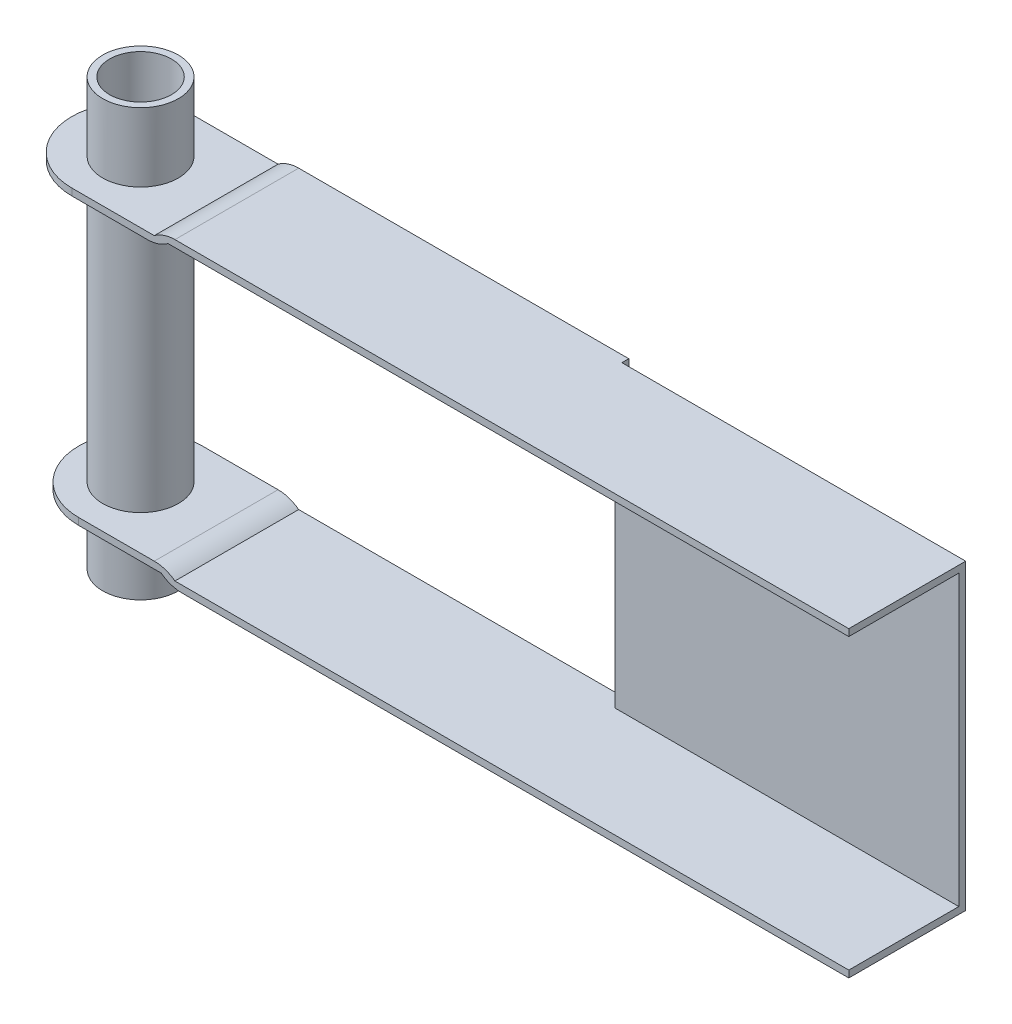
ISO-10303-21;
HEADER;
FILE_DESCRIPTION(('STEP AP214'),'2;1');
FILE_NAME('part.step','',(''),(''),'','','');
FILE_SCHEMA(('AUTOMOTIVE_DESIGN { 1 0 10303 214 1 1 1 1 }'));
ENDSEC;
DATA;
#1=APPLICATION_CONTEXT('core data for automotive mechanical design processes');
#2=APPLICATION_PROTOCOL_DEFINITION('international standard','automotive_design',2000,#1);
#3=PRODUCT_CONTEXT('',#1,'mechanical');
#4=PRODUCT('Part','Part','',(#3));
#5=PRODUCT_RELATED_PRODUCT_CATEGORY('part','',(#4));
#6=PRODUCT_DEFINITION_FORMATION('','',#4);
#7=PRODUCT_DEFINITION_CONTEXT('part definition',#1,'design');
#8=PRODUCT_DEFINITION('design','',#6,#7);
#9=PRODUCT_DEFINITION_SHAPE('','',#8);
#10=(LENGTH_UNIT() NAMED_UNIT(*) SI_UNIT(.MILLI.,.METRE.));
#11=(NAMED_UNIT(*) PLANE_ANGLE_UNIT() SI_UNIT($,.RADIAN.));
#12=(NAMED_UNIT(*) SI_UNIT($,.STERADIAN.) SOLID_ANGLE_UNIT());
#13=UNCERTAINTY_MEASURE_WITH_UNIT(LENGTH_MEASURE(1.E-05),#10,'distance_accuracy_value','');
#14=(GEOMETRIC_REPRESENTATION_CONTEXT(3) GLOBAL_UNCERTAINTY_ASSIGNED_CONTEXT((#13)) GLOBAL_UNIT_ASSIGNED_CONTEXT((#10,
#11,#12)) REPRESENTATION_CONTEXT('',''));
#15=CARTESIAN_POINT('',(0.,0.,0.));
#16=DIRECTION('',(0.,0.,1.));
#17=DIRECTION('',(1.,0.,0.));
#18=AXIS2_PLACEMENT_3D('',#15,#16,#17);
#19=CARTESIAN_POINT('',(-62.,11.,8.));
#20=DIRECTION('',(0.,-1.,0.));
#21=DIRECTION('',(0.,0.,-1.));
#22=AXIS2_PLACEMENT_3D('',#19,#20,#21);
#23=CYLINDRICAL_SURFACE('',#22,5.5);
#24=CARTESIAN_POINT('',(-62.,-1.,8.));
#25=DIRECTION('',(0.,-1.,0.));
#26=DIRECTION('',(0.,0.,-1.));
#27=AXIS2_PLACEMENT_3D('',#24,#25,#26);
#28=CIRCLE('',#27,5.5);
#29=CARTESIAN_POINT('',(-62.,-1.,2.50000000000001));
#30=VERTEX_POINT('',#29);
#31=EDGE_CURVE('E45',#30,#30,#28,.T.);
#32=ORIENTED_EDGE('',*,*,#31,.F.);
#33=EDGE_LOOP('',(#32));
#34=FACE_BOUND('',#33,.T.);
#35=CARTESIAN_POINT('',(-62.,9.00000000000002,8.));
#36=DIRECTION('',(0.,1.,0.));
#37=DIRECTION('',(0.,0.,1.));
#38=AXIS2_PLACEMENT_3D('',#35,#36,#37);
#39=CIRCLE('',#38,5.5);
#40=CARTESIAN_POINT('',(-62.,9.00000000000002,13.5));
#41=VERTEX_POINT('',#40);
#42=EDGE_CURVE('E568',#41,#41,#39,.T.);
#43=ORIENTED_EDGE('',*,*,#42,.F.);
#44=EDGE_LOOP('',(#43));
#45=FACE_BOUND('',#44,.T.);
#46=ADVANCED_FACE('F41',(#34,#45),#23,.T.);
#47=CARTESIAN_POINT('',(0.,-43.,17.));
#48=DIRECTION('',(0.,1.,0.));
#49=DIRECTION('',(0.,0.,1.));
#50=AXIS2_PLACEMENT_3D('',#47,#48,#49);
#51=PLANE('',#50);
#52=DIRECTION('',(1.,0.,0.));
#53=VECTOR('',#52,1.);
#54=CARTESIAN_POINT('',(-50.,-43.,-0.999999999999997));
#55=LINE('',#54,#53);
#56=CARTESIAN_POINT('',(-48.,-43.,-0.999999999999997));
#57=VERTEX_POINT('',#56);
#58=CARTESIAN_POINT('',(0.,-43.,-0.999999999999997));
#59=VERTEX_POINT('',#58);
#60=EDGE_CURVE('E218',#57,#59,#55,.T.);
#61=ORIENTED_EDGE('',*,*,#60,.F.);
#62=DIRECTION('',(0.,0.,-1.));
#63=VECTOR('',#62,1.);
#64=CARTESIAN_POINT('',(-48.,-43.,-0.999999999999997));
#65=LINE('',#64,#63);
#66=CARTESIAN_POINT('',(-48.,-43.,17.));
#67=VERTEX_POINT('',#66);
#68=EDGE_CURVE('E203',#67,#57,#65,.T.);
#69=ORIENTED_EDGE('',*,*,#68,.F.);
#70=DIRECTION('',(1.,0.,0.));
#71=VECTOR('',#70,1.);
#72=CARTESIAN_POINT('',(0.,-43.,17.));
#73=LINE('',#72,#71);
#74=CARTESIAN_POINT('',(50.,-43.,17.));
#75=VERTEX_POINT('',#74);
#76=EDGE_CURVE('E215',#67,#75,#73,.T.);
#77=ORIENTED_EDGE('',*,*,#76,.T.);
#78=DIRECTION('',(0.,0.,-1.));
#79=VECTOR('',#78,1.);
#80=CARTESIAN_POINT('',(50.,-43.,17.));
#81=LINE('',#80,#79);
#82=CARTESIAN_POINT('',(50.,-43.,1.));
#83=VERTEX_POINT('',#82);
#84=EDGE_CURVE('E236',#75,#83,#81,.T.);
#85=ORIENTED_EDGE('',*,*,#84,.T.);
#86=DIRECTION('',(1.,0.,0.));
#87=VECTOR('',#86,1.);
#88=CARTESIAN_POINT('',(0.,-43.,1.));
#89=LINE('',#88,#87);
#90=CARTESIAN_POINT('',(0.,-43.,1.));
#91=VERTEX_POINT('',#90);
#92=EDGE_CURVE('E228',#91,#83,#89,.T.);
#93=ORIENTED_EDGE('',*,*,#92,.F.);
#94=DIRECTION('',(0.,0.,-1.));
#95=VECTOR('',#94,1.);
#96=CARTESIAN_POINT('',(0.,-43.,0.));
#97=LINE('',#96,#95);
#98=CARTESIAN_POINT('',(0.,-43.,0.));
#99=VERTEX_POINT('',#98);
#100=EDGE_CURVE('E276',#91,#99,#97,.T.);
#101=ORIENTED_EDGE('',*,*,#100,.T.);
#102=EDGE_CURVE('E374',#99,#59,#97,.T.);
#103=ORIENTED_EDGE('',*,*,#102,.T.);
#104=EDGE_LOOP('',(#61,#69,#77,#85,#93,#101,#103));
#105=FACE_BOUND('',#104,.T.);
#106=ADVANCED_FACE('F213',(#105),#51,.T.);
#107=CARTESIAN_POINT('',(0.,0.,1.));
#108=DIRECTION('',(1.,0.,0.));
#109=DIRECTION('',(0.,0.,-1.));
#110=AXIS2_PLACEMENT_3D('',#107,#108,#109);
#111=PLANE('',#110);
#112=DIRECTION('',(0.,-1.,0.));
#113=VECTOR('',#112,1.);
#114=CARTESIAN_POINT('',(0.,0.,1.));
#115=LINE('',#114,#113);
#116=CARTESIAN_POINT('',(0.,-1.,1.));
#117=VERTEX_POINT('',#116);
#118=EDGE_CURVE('E255',#117,#91,#115,.T.);
#119=ORIENTED_EDGE('',*,*,#118,.F.);
#120=DIRECTION('',(0.,0.,-1.));
#121=VECTOR('',#120,1.);
#122=CARTESIAN_POINT('',(0.,-1.,0.));
#123=LINE('',#122,#121);
#124=CARTESIAN_POINT('',(0.,-1.,0.));
#125=VERTEX_POINT('',#124);
#126=EDGE_CURVE('E366',#117,#125,#123,.T.);
#127=ORIENTED_EDGE('',*,*,#126,.T.);
#128=DIRECTION('',(0.,-1.,0.));
#129=VECTOR('',#128,1.);
#130=CARTESIAN_POINT('',(0.,0.,0.));
#131=LINE('',#130,#129);
#132=EDGE_CURVE('E265',#125,#99,#131,.T.);
#133=ORIENTED_EDGE('',*,*,#132,.T.);
#134=ORIENTED_EDGE('',*,*,#100,.F.);
#135=EDGE_LOOP('',(#119,#127,#133,#134));
#136=FACE_BOUND('',#135,.T.);
#137=ADVANCED_FACE('F446',(#136),#111,.F.);
#138=CARTESIAN_POINT('',(0.,0.,1.));
#139=DIRECTION('',(0.,0.,1.));
#140=DIRECTION('',(1.,0.,0.));
#141=AXIS2_PLACEMENT_3D('',#138,#139,#140);
#142=PLANE('',#141);
#143=ORIENTED_EDGE('',*,*,#92,.T.);
#144=DIRECTION('',(0.,1.,0.));
#145=VECTOR('',#144,1.);
#146=CARTESIAN_POINT('',(50.,0.,1.));
#147=LINE('',#146,#145);
#148=CARTESIAN_POINT('',(50.,-1.,1.));
#149=VERTEX_POINT('',#148);
#150=EDGE_CURVE('E258',#83,#149,#147,.T.);
#151=ORIENTED_EDGE('',*,*,#150,.T.);
#152=DIRECTION('',(-1.,0.,0.));
#153=VECTOR('',#152,1.);
#154=CARTESIAN_POINT('',(0.,-1.,1.));
#155=LINE('',#154,#153);
#156=EDGE_CURVE('E239',#149,#117,#155,.T.);
#157=ORIENTED_EDGE('',*,*,#156,.T.);
#158=ORIENTED_EDGE('',*,*,#118,.T.);
#159=EDGE_LOOP('',(#143,#151,#157,#158));
#160=FACE_BOUND('',#159,.T.);
#161=ADVANCED_FACE('F448',(#160),#142,.T.);
#162=CARTESIAN_POINT('',(0.,-44.,1.));
#163=DIRECTION('',(0.,1.,0.));
#164=DIRECTION('',(0.,0.,1.));
#165=AXIS2_PLACEMENT_3D('',#162,#163,#164);
#166=PLANE('',#165);
#167=DIRECTION('',(1.,0.,0.));
#168=VECTOR('',#167,1.);
#169=CARTESIAN_POINT('',(0.,-44.,17.));
#170=LINE('',#169,#168);
#171=CARTESIAN_POINT('',(-47.,-44.,17.));
#172=VERTEX_POINT('',#171);
#173=CARTESIAN_POINT('',(50.,-44.,17.));
#174=VERTEX_POINT('',#173);
#175=EDGE_CURVE('E227',#172,#174,#170,.T.);
#176=ORIENTED_EDGE('',*,*,#175,.F.);
#177=DIRECTION('',(0.,0.,-1.));
#178=VECTOR('',#177,1.);
#179=CARTESIAN_POINT('',(-47.,-44.,1.));
#180=LINE('',#179,#178);
#181=CARTESIAN_POINT('',(-47.,-44.,-0.999999999999997));
#182=VERTEX_POINT('',#181);
#183=EDGE_CURVE('E320',#172,#182,#180,.T.);
#184=ORIENTED_EDGE('',*,*,#183,.T.);
#185=DIRECTION('',(1.,0.,0.));
#186=VECTOR('',#185,1.);
#187=CARTESIAN_POINT('',(-50.,-44.,-0.999999999999997));
#188=LINE('',#187,#186);
#189=CARTESIAN_POINT('',(0.,-44.,-0.999999999999997));
#190=VERTEX_POINT('',#189);
#191=EDGE_CURVE('E381',#182,#190,#188,.T.);
#192=ORIENTED_EDGE('',*,*,#191,.T.);
#193=DIRECTION('',(0.,0.,1.));
#194=VECTOR('',#193,1.);
#195=CARTESIAN_POINT('',(0.,-44.,0.));
#196=LINE('',#195,#194);
#197=CARTESIAN_POINT('',(0.,-44.,0.));
#198=VERTEX_POINT('',#197);
#199=EDGE_CURVE('E379',#190,#198,#196,.T.);
#200=ORIENTED_EDGE('',*,*,#199,.T.);
#201=DIRECTION('',(1.,0.,0.));
#202=VECTOR('',#201,1.);
#203=CARTESIAN_POINT('',(0.,-44.,0.));
#204=LINE('',#203,#202);
#205=CARTESIAN_POINT('',(50.,-44.,0.));
#206=VERTEX_POINT('',#205);
#207=EDGE_CURVE('E264',#198,#206,#204,.T.);
#208=ORIENTED_EDGE('',*,*,#207,.T.);
#209=DIRECTION('',(0.,0.,-1.));
#210=VECTOR('',#209,1.);
#211=CARTESIAN_POINT('',(50.,-44.,1.));
#212=LINE('',#211,#210);
#213=EDGE_CURVE('E273',#174,#206,#212,.T.);
#214=ORIENTED_EDGE('',*,*,#213,.F.);
#215=EDGE_LOOP('',(#176,#184,#192,#200,#208,#214));
#216=FACE_BOUND('',#215,.T.);
#217=ADVANCED_FACE('F397',(#216),#166,.F.);
#218=CARTESIAN_POINT('',(50.,0.,1.));
#219=DIRECTION('',(-1.,0.,0.));
#220=DIRECTION('',(0.,-1.,0.));
#221=AXIS2_PLACEMENT_3D('',#218,#219,#220);
#222=PLANE('',#221);
#223=DIRECTION('',(0.,1.,0.));
#224=VECTOR('',#223,1.);
#225=CARTESIAN_POINT('',(50.,0.,0.));
#226=LINE('',#225,#224);
#227=CARTESIAN_POINT('',(50.,0.,0.));
#228=VERTEX_POINT('',#227);
#229=EDGE_CURVE('E267',#206,#228,#226,.T.);
#230=ORIENTED_EDGE('',*,*,#229,.T.);
#231=DIRECTION('',(0.,0.,-1.));
#232=VECTOR('',#231,1.);
#233=CARTESIAN_POINT('',(50.,0.,1.));
#234=LINE('',#233,#232);
#235=CARTESIAN_POINT('',(50.,0.,17.));
#236=VERTEX_POINT('',#235);
#237=EDGE_CURVE('E261',#236,#228,#234,.T.);
#238=ORIENTED_EDGE('',*,*,#237,.F.);
#239=DIRECTION('',(0.,1.,0.));
#240=VECTOR('',#239,1.);
#241=CARTESIAN_POINT('',(50.,0.,17.));
#242=LINE('',#241,#240);
#243=CARTESIAN_POINT('',(50.,-1.,17.));
#244=VERTEX_POINT('',#243);
#245=EDGE_CURVE('E243',#244,#236,#242,.T.);
#246=ORIENTED_EDGE('',*,*,#245,.F.);
#247=DIRECTION('',(0.,0.,-1.));
#248=VECTOR('',#247,1.);
#249=CARTESIAN_POINT('',(50.,-1.,17.));
#250=LINE('',#249,#248);
#251=EDGE_CURVE('E249',#244,#149,#250,.T.);
#252=ORIENTED_EDGE('',*,*,#251,.T.);
#253=ORIENTED_EDGE('',*,*,#150,.F.);
#254=ORIENTED_EDGE('',*,*,#84,.F.);
#255=DIRECTION('',(0.,1.,0.));
#256=VECTOR('',#255,1.);
#257=CARTESIAN_POINT('',(50.,0.,17.));
#258=LINE('',#257,#256);
#259=EDGE_CURVE('E225',#174,#75,#258,.T.);
#260=ORIENTED_EDGE('',*,*,#259,.F.);
#261=ORIENTED_EDGE('',*,*,#213,.T.);
#262=EDGE_LOOP('',(#230,#238,#246,#252,#253,#254,#260,#261));
#263=FACE_BOUND('',#262,.T.);
#264=ADVANCED_FACE('F402',(#263),#222,.F.);
#265=CARTESIAN_POINT('',(0.,0.,1.));
#266=DIRECTION('',(0.,-1.,0.));
#267=DIRECTION('',(0.,0.,-1.));
#268=AXIS2_PLACEMENT_3D('',#265,#266,#267);
#269=PLANE('',#268);
#270=DIRECTION('',(1.,0.,0.));
#271=VECTOR('',#270,1.);
#272=CARTESIAN_POINT('',(-50.,0.,-0.999999999999997));
#273=LINE('',#272,#271);
#274=CARTESIAN_POINT('',(-48.,0.,-0.999999999999997));
#275=VERTEX_POINT('',#274);
#276=CARTESIAN_POINT('',(0.,0.,-0.999999999999997));
#277=VERTEX_POINT('',#276);
#278=EDGE_CURVE('E370',#275,#277,#273,.T.);
#279=ORIENTED_EDGE('',*,*,#278,.F.);
#280=DIRECTION('',(0.,0.,-1.));
#281=VECTOR('',#280,1.);
#282=CARTESIAN_POINT('',(-48.,0.,1.));
#283=LINE('',#282,#281);
#284=CARTESIAN_POINT('',(-48.,0.,17.));
#285=VERTEX_POINT('',#284);
#286=EDGE_CURVE('E324',#275,#285,#283,.F.);
#287=ORIENTED_EDGE('',*,*,#286,.T.);
#288=DIRECTION('',(-1.,0.,0.));
#289=VECTOR('',#288,1.);
#290=CARTESIAN_POINT('',(0.,0.,17.));
#291=LINE('',#290,#289);
#292=EDGE_CURVE('E246',#236,#285,#291,.T.);
#293=ORIENTED_EDGE('',*,*,#292,.F.);
#294=ORIENTED_EDGE('',*,*,#237,.T.);
#295=DIRECTION('',(-1.,0.,0.));
#296=VECTOR('',#295,1.);
#297=CARTESIAN_POINT('',(0.,0.,0.));
#298=LINE('',#297,#296);
#299=CARTESIAN_POINT('',(0.,0.,0.));
#300=VERTEX_POINT('',#299);
#301=EDGE_CURVE('E259',#228,#300,#298,.T.);
#302=ORIENTED_EDGE('',*,*,#301,.T.);
#303=DIRECTION('',(0.,0.,-1.));
#304=VECTOR('',#303,1.);
#305=CARTESIAN_POINT('',(0.,0.,0.));
#306=LINE('',#305,#304);
#307=EDGE_CURVE('E367',#300,#277,#306,.T.);
#308=ORIENTED_EDGE('',*,*,#307,.T.);
#309=EDGE_LOOP('',(#279,#287,#293,#294,#302,#308));
#310=FACE_BOUND('',#309,.T.);
#311=ADVANCED_FACE('F408',(#310),#269,.F.);
#312=CARTESIAN_POINT('',(0.,0.,0.));
#313=DIRECTION('',(0.,0.,1.));
#314=DIRECTION('',(1.,0.,0.));
#315=AXIS2_PLACEMENT_3D('',#312,#313,#314);
#316=PLANE('',#315);
#317=EDGE_CURVE('E262',#300,#125,#131,.T.);
#318=ORIENTED_EDGE('',*,*,#317,.F.);
#319=ORIENTED_EDGE('',*,*,#301,.F.);
#320=ORIENTED_EDGE('',*,*,#229,.F.);
#321=ORIENTED_EDGE('',*,*,#207,.F.);
#322=EDGE_CURVE('E254',#99,#198,#131,.T.);
#323=ORIENTED_EDGE('',*,*,#322,.F.);
#324=ORIENTED_EDGE('',*,*,#132,.F.);
#325=EDGE_LOOP('',(#318,#319,#320,#321,#323,#324));
#326=FACE_BOUND('',#325,.T.);
#327=ADVANCED_FACE('F405',(#326),#316,.F.);
#328=CARTESIAN_POINT('',(0.,-1.,17.));
#329=DIRECTION('',(0.,-1.,0.));
#330=DIRECTION('',(0.,0.,-1.));
#331=AXIS2_PLACEMENT_3D('',#328,#329,#330);
#332=PLANE('',#331);
#333=DIRECTION('',(0.,0.,1.));
#334=VECTOR('',#333,1.);
#335=CARTESIAN_POINT('',(-49.,-1.,-0.999999999999997));
#336=LINE('',#335,#334);
#337=CARTESIAN_POINT('',(-49.,-1.,-0.999999999999997));
#338=VERTEX_POINT('',#337);
#339=CARTESIAN_POINT('',(-49.,-1.,17.));
#340=VERTEX_POINT('',#339);
#341=EDGE_CURVE('E220',#338,#340,#336,.T.);
#342=ORIENTED_EDGE('',*,*,#341,.F.);
#343=DIRECTION('',(1.,0.,0.));
#344=VECTOR('',#343,1.);
#345=CARTESIAN_POINT('',(-50.,-1.,-0.999999999999997));
#346=LINE('',#345,#344);
#347=CARTESIAN_POINT('',(0.,-1.,-0.999999999999997));
#348=VERTEX_POINT('',#347);
#349=EDGE_CURVE('E372',#338,#348,#346,.T.);
#350=ORIENTED_EDGE('',*,*,#349,.T.);
#351=EDGE_CURVE('E363',#125,#348,#123,.T.);
#352=ORIENTED_EDGE('',*,*,#351,.F.);
#353=ORIENTED_EDGE('',*,*,#126,.F.);
#354=ORIENTED_EDGE('',*,*,#156,.F.);
#355=ORIENTED_EDGE('',*,*,#251,.F.);
#356=DIRECTION('',(-1.,0.,0.));
#357=VECTOR('',#356,1.);
#358=CARTESIAN_POINT('',(0.,-1.,17.));
#359=LINE('',#358,#357);
#360=EDGE_CURVE('E240',#244,#340,#359,.T.);
#361=ORIENTED_EDGE('',*,*,#360,.T.);
#362=EDGE_LOOP('',(#342,#350,#352,#353,#354,#355,#361));
#363=FACE_BOUND('',#362,.T.);
#364=ADVANCED_FACE('F417',(#363),#332,.T.);
#365=CARTESIAN_POINT('',(0.,0.,17.));
#366=DIRECTION('',(0.,0.,1.));
#367=DIRECTION('',(1.,0.,0.));
#368=AXIS2_PLACEMENT_3D('',#365,#366,#367);
#369=PLANE('',#368);
#370=ORIENTED_EDGE('',*,*,#292,.T.);
#371=CARTESIAN_POINT('',(-48.,-5.,17.));
#372=DIRECTION('',(0.,0.,1.));
#373=DIRECTION('',(1.,0.,0.));
#374=AXIS2_PLACEMENT_3D('',#371,#372,#373);
#375=CIRCLE('',#374,5.);
#376=CARTESIAN_POINT('',(-51.,-1.,17.));
#377=VERTEX_POINT('',#376);
#378=EDGE_CURVE('E58',#285,#377,#375,.T.);
#379=ORIENTED_EDGE('',*,*,#378,.T.);
#380=DIRECTION('',(1.,0.,0.));
#381=VECTOR('',#380,1.);
#382=CARTESIAN_POINT('',(-72.,-1.,17.));
#383=LINE('',#382,#381);
#384=CARTESIAN_POINT('',(-63.,-1.,17.));
#385=VERTEX_POINT('',#384);
#386=EDGE_CURVE('E338',#385,#377,#383,.T.);
#387=ORIENTED_EDGE('',*,*,#386,.F.);
#388=DIRECTION('',(0.,1.,0.));
#389=VECTOR('',#388,1.);
#390=CARTESIAN_POINT('',(-63.,-2.,17.));
#391=LINE('',#390,#389);
#392=CARTESIAN_POINT('',(-63.,-2.,17.));
#393=VERTEX_POINT('',#392);
#394=EDGE_CURVE('E289',#385,#393,#391,.F.);
#395=ORIENTED_EDGE('',*,*,#394,.T.);
#396=DIRECTION('',(1.,0.,0.));
#397=VECTOR('',#396,1.);
#398=CARTESIAN_POINT('',(0.,-2.,17.));
#399=LINE('',#398,#397);
#400=CARTESIAN_POINT('',(-52.,-2.,17.));
#401=VERTEX_POINT('',#400);
#402=EDGE_CURVE('E355',#393,#401,#399,.T.);
#403=ORIENTED_EDGE('',*,*,#402,.T.);
#404=CARTESIAN_POINT('',(-52.,3.,17.));
#405=DIRECTION('',(0.,0.,1.));
#406=DIRECTION('',(1.,0.,0.));
#407=AXIS2_PLACEMENT_3D('',#404,#405,#406);
#408=CIRCLE('',#407,5.);
#409=EDGE_CURVE('E316',#401,#340,#408,.T.);
#410=ORIENTED_EDGE('',*,*,#409,.T.);
#411=ORIENTED_EDGE('',*,*,#360,.F.);
#412=ORIENTED_EDGE('',*,*,#245,.T.);
#413=EDGE_LOOP('',(#370,#379,#387,#395,#403,#410,#411,#412));
#414=FACE_BOUND('',#413,.T.);
#415=ADVANCED_FACE('F413',(#414),#369,.T.);
#416=CARTESIAN_POINT('',(0.,0.,17.));
#417=DIRECTION('',(0.,0.,1.));
#418=DIRECTION('',(1.,0.,0.));
#419=AXIS2_PLACEMENT_3D('',#416,#417,#418);
#420=PLANE('',#419);
#421=DIRECTION('',(1.,0.,0.));
#422=VECTOR('',#421,1.);
#423=CARTESIAN_POINT('',(-71.,-43.,17.));
#424=LINE('',#423,#422);
#425=CARTESIAN_POINT('',(-62.,-43.,17.));
#426=VERTEX_POINT('',#425);
#427=CARTESIAN_POINT('',(-50.,-43.,17.));
#428=VERTEX_POINT('',#427);
#429=EDGE_CURVE('E346',#426,#428,#424,.T.);
#430=ORIENTED_EDGE('',*,*,#429,.T.);
#431=CARTESIAN_POINT('',(-47.,-39.,17.));
#432=DIRECTION('',(0.,0.,1.));
#433=DIRECTION('',(1.,0.,0.));
#434=AXIS2_PLACEMENT_3D('',#431,#432,#433);
#435=CIRCLE('',#434,5.);
#436=EDGE_CURVE('E318',#428,#172,#435,.T.);
#437=ORIENTED_EDGE('',*,*,#436,.T.);
#438=ORIENTED_EDGE('',*,*,#175,.T.);
#439=ORIENTED_EDGE('',*,*,#259,.T.);
#440=ORIENTED_EDGE('',*,*,#76,.F.);
#441=CARTESIAN_POINT('',(-51.,-47.,17.));
#442=DIRECTION('',(0.,0.,1.));
#443=DIRECTION('',(1.,0.,0.));
#444=AXIS2_PLACEMENT_3D('',#441,#442,#443);
#445=CIRCLE('',#444,5.);
#446=CARTESIAN_POINT('',(-51.,-42.,17.));
#447=VERTEX_POINT('',#446);
#448=EDGE_CURVE('E199',#67,#447,#445,.T.);
#449=ORIENTED_EDGE('',*,*,#448,.T.);
#450=DIRECTION('',(1.,0.,0.));
#451=VECTOR('',#450,1.);
#452=CARTESIAN_POINT('',(-50.,-42.,17.));
#453=LINE('',#452,#451);
#454=CARTESIAN_POINT('',(-62.,-42.,17.));
#455=VERTEX_POINT('',#454);
#456=EDGE_CURVE('E353',#455,#447,#453,.T.);
#457=ORIENTED_EDGE('',*,*,#456,.F.);
#458=DIRECTION('',(0.,1.,0.));
#459=VECTOR('',#458,1.);
#460=CARTESIAN_POINT('',(-62.,-43.,17.));
#461=LINE('',#460,#459);
#462=EDGE_CURVE('E209',#455,#426,#461,.F.);
#463=ORIENTED_EDGE('',*,*,#462,.T.);
#464=EDGE_LOOP('',(#430,#437,#438,#439,#440,#449,#457,#463));
#465=FACE_BOUND('',#464,.T.);
#466=ADVANCED_FACE('F223',(#465),#420,.T.);
#467=CARTESIAN_POINT('',(0.,0.,0.));
#468=DIRECTION('',(-1.,0.,0.));
#469=DIRECTION('',(0.,0.,1.));
#470=AXIS2_PLACEMENT_3D('',#467,#468,#469);
#471=PLANE('',#470);
#472=ORIENTED_EDGE('',*,*,#102,.F.);
#473=ORIENTED_EDGE('',*,*,#322,.T.);
#474=ORIENTED_EDGE('',*,*,#199,.F.);
#475=DIRECTION('',(0.,-1.,0.));
#476=VECTOR('',#475,1.);
#477=CARTESIAN_POINT('',(0.,0.,-0.999999999999997));
#478=LINE('',#477,#476);
#479=EDGE_CURVE('E376',#59,#190,#478,.T.);
#480=ORIENTED_EDGE('',*,*,#479,.F.);
#481=EDGE_LOOP('',(#472,#473,#474,#480));
#482=FACE_BOUND('',#481,.T.);
#483=ADVANCED_FACE('F394',(#482),#471,.F.);
#484=CARTESIAN_POINT('',(-50.,0.,-0.999999999999997));
#485=DIRECTION('',(0.,0.,1.));
#486=DIRECTION('',(1.,0.,0.));
#487=AXIS2_PLACEMENT_3D('',#484,#485,#486);
#488=PLANE('',#487);
#489=ORIENTED_EDGE('',*,*,#191,.F.);
#490=CARTESIAN_POINT('',(-47.,-39.,-0.999999999999997));
#491=DIRECTION('',(0.,0.,1.));
#492=DIRECTION('',(1.,0.,0.));
#493=AXIS2_PLACEMENT_3D('',#490,#491,#492);
#494=CIRCLE('',#493,5.);
#495=CARTESIAN_POINT('',(-50.,-43.,-0.999999999999997));
#496=VERTEX_POINT('',#495);
#497=EDGE_CURVE('E322',#182,#496,#494,.F.);
#498=ORIENTED_EDGE('',*,*,#497,.T.);
#499=DIRECTION('',(1.,0.,0.));
#500=VECTOR('',#499,1.);
#501=CARTESIAN_POINT('',(-71.,-43.,-0.999999999999997));
#502=LINE('',#501,#500);
#503=CARTESIAN_POINT('',(-62.,-43.,-0.999999999999997));
#504=VERTEX_POINT('',#503);
#505=EDGE_CURVE('E348',#504,#496,#502,.T.);
#506=ORIENTED_EDGE('',*,*,#505,.F.);
#507=DIRECTION('',(0.,-1.,0.));
#508=VECTOR('',#507,1.);
#509=CARTESIAN_POINT('',(-62.,0.,-0.999999999999997));
#510=LINE('',#509,#508);
#511=CARTESIAN_POINT('',(-62.,-42.,-0.999999999999997));
#512=VERTEX_POINT('',#511);
#513=EDGE_CURVE('E299',#504,#512,#510,.F.);
#514=ORIENTED_EDGE('',*,*,#513,.T.);
#515=DIRECTION('',(-1.,0.,0.));
#516=VECTOR('',#515,1.);
#517=CARTESIAN_POINT('',(-49.,-42.,-0.999999999999997));
#518=LINE('',#517,#516);
#519=CARTESIAN_POINT('',(-51.,-42.,-0.999999999999997));
#520=VERTEX_POINT('',#519);
#521=EDGE_CURVE('E351',#520,#512,#518,.T.);
#522=ORIENTED_EDGE('',*,*,#521,.F.);
#523=CARTESIAN_POINT('',(-51.,-47.,-0.999999999999997));
#524=DIRECTION('',(0.,0.,1.));
#525=DIRECTION('',(1.,0.,0.));
#526=AXIS2_PLACEMENT_3D('',#523,#524,#525);
#527=CIRCLE('',#526,5.);
#528=EDGE_CURVE('E310',#520,#57,#527,.F.);
#529=ORIENTED_EDGE('',*,*,#528,.T.);
#530=ORIENTED_EDGE('',*,*,#60,.T.);
#531=ORIENTED_EDGE('',*,*,#479,.T.);
#532=EDGE_LOOP('',(#489,#498,#506,#514,#522,#529,#530,#531));
#533=FACE_BOUND('',#532,.T.);
#534=ADVANCED_FACE('F385',(#533),#488,.F.);
#535=CARTESIAN_POINT('',(0.,0.,0.));
#536=DIRECTION('',(-1.,0.,0.));
#537=DIRECTION('',(0.,0.,1.));
#538=AXIS2_PLACEMENT_3D('',#535,#536,#537);
#539=PLANE('',#538);
#540=ORIENTED_EDGE('',*,*,#307,.F.);
#541=ORIENTED_EDGE('',*,*,#317,.T.);
#542=ORIENTED_EDGE('',*,*,#351,.T.);
#543=DIRECTION('',(0.,1.,0.));
#544=VECTOR('',#543,1.);
#545=CARTESIAN_POINT('',(0.,0.,-0.999999999999997));
#546=LINE('',#545,#544);
#547=EDGE_CURVE('E360',#348,#277,#546,.T.);
#548=ORIENTED_EDGE('',*,*,#547,.T.);
#549=EDGE_LOOP('',(#540,#541,#542,#548));
#550=FACE_BOUND('',#549,.T.);
#551=ADVANCED_FACE('F441',(#550),#539,.F.);
#552=CARTESIAN_POINT('',(-50.,0.,-0.999999999999997));
#553=DIRECTION('',(0.,0.,-1.));
#554=DIRECTION('',(-1.,0.,0.));
#555=AXIS2_PLACEMENT_3D('',#552,#553,#554);
#556=PLANE('',#555);
#557=DIRECTION('',(1.,0.,0.));
#558=VECTOR('',#557,1.);
#559=CARTESIAN_POINT('',(-72.,-1.,-0.999999999999998));
#560=LINE('',#559,#558);
#561=CARTESIAN_POINT('',(-63.,-1.,-0.999999999999998));
#562=VERTEX_POINT('',#561);
#563=CARTESIAN_POINT('',(-51.,-1.,-0.999999999999998));
#564=VERTEX_POINT('',#563);
#565=EDGE_CURVE('E341',#562,#564,#560,.T.);
#566=ORIENTED_EDGE('',*,*,#565,.T.);
#567=CARTESIAN_POINT('',(-48.,-5.,-0.999999999999997));
#568=DIRECTION('',(0.,0.,-1.));
#569=DIRECTION('',(-1.,0.,0.));
#570=AXIS2_PLACEMENT_3D('',#567,#568,#569);
#571=CIRCLE('',#570,5.);
#572=EDGE_CURVE('E66',#564,#275,#571,.T.);
#573=ORIENTED_EDGE('',*,*,#572,.T.);
#574=ORIENTED_EDGE('',*,*,#278,.T.);
#575=ORIENTED_EDGE('',*,*,#547,.F.);
#576=ORIENTED_EDGE('',*,*,#349,.F.);
#577=CARTESIAN_POINT('',(-52.,3.,-0.999999999999997));
#578=DIRECTION('',(0.,0.,-1.));
#579=DIRECTION('',(-1.,0.,0.));
#580=AXIS2_PLACEMENT_3D('',#577,#578,#579);
#581=CIRCLE('',#580,5.);
#582=CARTESIAN_POINT('',(-52.,-2.,-0.999999999999998));
#583=VERTEX_POINT('',#582);
#584=EDGE_CURVE('E312',#338,#583,#581,.T.);
#585=ORIENTED_EDGE('',*,*,#584,.T.);
#586=DIRECTION('',(-1.,0.,0.));
#587=VECTOR('',#586,1.);
#588=CARTESIAN_POINT('',(0.,-2.,-0.999999999999976));
#589=LINE('',#588,#587);
#590=CARTESIAN_POINT('',(-63.,-2.,-1.));
#591=VERTEX_POINT('',#590);
#592=EDGE_CURVE('E358',#583,#591,#589,.T.);
#593=ORIENTED_EDGE('',*,*,#592,.T.);
#594=DIRECTION('',(0.,-1.,0.));
#595=VECTOR('',#594,1.);
#596=CARTESIAN_POINT('',(-63.,-1.,-0.999999999999997));
#597=LINE('',#596,#595);
#598=EDGE_CURVE('E282',#591,#562,#597,.F.);
#599=ORIENTED_EDGE('',*,*,#598,.T.);
#600=EDGE_LOOP('',(#566,#573,#574,#575,#576,#585,#593,#599));
#601=FACE_BOUND('',#600,.T.);
#602=ADVANCED_FACE('F424',(#601),#556,.T.);
#603=CARTESIAN_POINT('',(0.,-2.,0.));
#604=DIRECTION('',(0.,-1.,0.));
#605=DIRECTION('',(0.,0.,-1.));
#606=AXIS2_PLACEMENT_3D('',#603,#604,#605);
#607=PLANE('',#606);
#608=CARTESIAN_POINT('',(-62.,-2.,8.));
#609=DIRECTION('',(0.,-1.,0.));
#610=DIRECTION('',(0.,0.,-1.));
#611=AXIS2_PLACEMENT_3D('',#608,#609,#610);
#612=CIRCLE('',#611,5.5);
#613=CARTESIAN_POINT('',(-62.,-2.,2.50000000000001));
#614=VERTEX_POINT('',#613);
#615=EDGE_CURVE('E11',#614,#614,#612,.T.);
#616=ORIENTED_EDGE('',*,*,#615,.F.);
#617=EDGE_LOOP('',(#616));
#618=FACE_BOUND('',#617,.T.);
#619=ORIENTED_EDGE('',*,*,#592,.F.);
#620=DIRECTION('',(0.,0.,1.));
#621=VECTOR('',#620,1.);
#622=CARTESIAN_POINT('',(-52.,-2.,17.));
#623=LINE('',#622,#621);
#624=EDGE_CURVE('E314',#583,#401,#623,.T.);
#625=ORIENTED_EDGE('',*,*,#624,.T.);
#626=ORIENTED_EDGE('',*,*,#402,.F.);
#627=CARTESIAN_POINT('',(-63.,-2.,8.));
#628=DIRECTION('',(0.,-1.,0.));
#629=DIRECTION('',(0.,0.,-1.));
#630=AXIS2_PLACEMENT_3D('',#627,#628,#629);
#631=CIRCLE('',#630,9.);
#632=CARTESIAN_POINT('',(-72.,-2.,8.));
#633=VERTEX_POINT('',#632);
#634=EDGE_CURVE('E277',#393,#633,#631,.T.);
#635=ORIENTED_EDGE('',*,*,#634,.T.);
#636=CARTESIAN_POINT('',(-63.,-2.,8.));
#637=DIRECTION('',(0.,-1.,0.));
#638=DIRECTION('',(0.,0.,-1.));
#639=AXIS2_PLACEMENT_3D('',#636,#637,#638);
#640=CIRCLE('',#639,9.);
#641=EDGE_CURVE('E279',#633,#591,#640,.T.);
#642=ORIENTED_EDGE('',*,*,#641,.T.);
#643=EDGE_LOOP('',(#619,#625,#626,#635,#642));
#644=FACE_BOUND('',#643,.T.);
#645=ADVANCED_FACE('F427',(#618,#644),#607,.T.);
#646=CARTESIAN_POINT('',(0.,-42.,0.));
#647=DIRECTION('',(0.,1.,0.));
#648=DIRECTION('',(0.,0.,1.));
#649=AXIS2_PLACEMENT_3D('',#646,#647,#648);
#650=PLANE('',#649);
#651=CARTESIAN_POINT('',(-62.,-42.,8.));
#652=DIRECTION('',(0.,1.,0.));
#653=DIRECTION('',(0.,0.,1.));
#654=AXIS2_PLACEMENT_3D('',#651,#652,#653);
#655=CIRCLE('',#654,5.5);
#656=CARTESIAN_POINT('',(-62.,-42.,13.5));
#657=VERTEX_POINT('',#656);
#658=EDGE_CURVE('E50',#657,#657,#655,.T.);
#659=ORIENTED_EDGE('',*,*,#658,.F.);
#660=EDGE_LOOP('',(#659));
#661=FACE_BOUND('',#660,.T.);
#662=ORIENTED_EDGE('',*,*,#456,.T.);
#663=DIRECTION('',(0.,0.,1.));
#664=VECTOR('',#663,1.);
#665=CARTESIAN_POINT('',(-51.,-42.,-0.999999999999997));
#666=LINE('',#665,#664);
#667=EDGE_CURVE('E204',#447,#520,#666,.F.);
#668=ORIENTED_EDGE('',*,*,#667,.T.);
#669=ORIENTED_EDGE('',*,*,#521,.T.);
#670=CARTESIAN_POINT('',(-62.,-42.,8.));
#671=DIRECTION('',(0.,1.,0.));
#672=DIRECTION('',(0.,0.,1.));
#673=AXIS2_PLACEMENT_3D('',#670,#671,#672);
#674=CIRCLE('',#673,9.);
#675=CARTESIAN_POINT('',(-71.,-42.,8.));
#676=VERTEX_POINT('',#675);
#677=EDGE_CURVE('E304',#512,#676,#674,.T.);
#678=ORIENTED_EDGE('',*,*,#677,.T.);
#679=CARTESIAN_POINT('',(-62.,-42.,8.));
#680=DIRECTION('',(0.,1.,0.));
#681=DIRECTION('',(0.,0.,1.));
#682=AXIS2_PLACEMENT_3D('',#679,#680,#681);
#683=CIRCLE('',#682,9.);
#684=EDGE_CURVE('E302',#676,#455,#683,.T.);
#685=ORIENTED_EDGE('',*,*,#684,.T.);
#686=EDGE_LOOP('',(#662,#668,#669,#678,#685));
#687=FACE_BOUND('',#686,.T.);
#688=ADVANCED_FACE('F487',(#661,#687),#650,.T.);
#689=CARTESIAN_POINT('',(-71.,-43.,17.));
#690=DIRECTION('',(0.,1.,0.));
#691=DIRECTION('',(0.,0.,1.));
#692=AXIS2_PLACEMENT_3D('',#689,#690,#691);
#693=PLANE('',#692);
#694=CARTESIAN_POINT('',(-62.,-43.,8.));
#695=DIRECTION('',(0.,1.,0.));
#696=DIRECTION('',(0.,0.,1.));
#697=AXIS2_PLACEMENT_3D('',#694,#695,#696);
#698=CIRCLE('',#697,5.5);
#699=CARTESIAN_POINT('',(-62.,-43.,13.5));
#700=VERTEX_POINT('',#699);
#701=EDGE_CURVE('E331',#700,#700,#698,.T.);
#702=ORIENTED_EDGE('',*,*,#701,.T.);
#703=EDGE_LOOP('',(#702));
#704=FACE_BOUND('',#703,.T.);
#705=CARTESIAN_POINT('',(-62.,-43.,8.));
#706=DIRECTION('',(0.,1.,0.));
#707=DIRECTION('',(0.,0.,1.));
#708=AXIS2_PLACEMENT_3D('',#705,#706,#707);
#709=CIRCLE('',#708,9.);
#710=CARTESIAN_POINT('',(-71.,-43.,8.));
#711=VERTEX_POINT('',#710);
#712=EDGE_CURVE('E291',#426,#711,#709,.F.);
#713=ORIENTED_EDGE('',*,*,#712,.T.);
#714=CARTESIAN_POINT('',(-62.,-43.,8.));
#715=DIRECTION('',(0.,1.,0.));
#716=DIRECTION('',(0.,0.,1.));
#717=AXIS2_PLACEMENT_3D('',#714,#715,#716);
#718=CIRCLE('',#717,9.);
#719=EDGE_CURVE('E297',#711,#504,#718,.F.);
#720=ORIENTED_EDGE('',*,*,#719,.T.);
#721=ORIENTED_EDGE('',*,*,#505,.T.);
#722=DIRECTION('',(0.,0.,1.));
#723=VECTOR('',#722,1.);
#724=CARTESIAN_POINT('',(-50.,-43.,17.));
#725=LINE('',#724,#723);
#726=EDGE_CURVE('E343',#496,#428,#725,.T.);
#727=ORIENTED_EDGE('',*,*,#726,.T.);
#728=ORIENTED_EDGE('',*,*,#429,.F.);
#729=EDGE_LOOP('',(#713,#720,#721,#727,#728));
#730=FACE_BOUND('',#729,.T.);
#731=ADVANCED_FACE('F493',(#704,#730),#693,.F.);
#732=CARTESIAN_POINT('',(-72.,-1.,-0.999999999999998));
#733=DIRECTION('',(0.,-1.,0.));
#734=DIRECTION('',(0.,0.,-1.));
#735=AXIS2_PLACEMENT_3D('',#732,#733,#734);
#736=PLANE('',#735);
#737=ORIENTED_EDGE('',*,*,#31,.T.);
#738=EDGE_LOOP('',(#737));
#739=FACE_BOUND('',#738,.T.);
#740=ORIENTED_EDGE('',*,*,#565,.F.);
#741=CARTESIAN_POINT('',(-63.,-1.,8.));
#742=DIRECTION('',(0.,-1.,0.));
#743=DIRECTION('',(0.,0.,-1.));
#744=AXIS2_PLACEMENT_3D('',#741,#742,#743);
#745=CIRCLE('',#744,9.);
#746=CARTESIAN_POINT('',(-72.,-1.,8.));
#747=VERTEX_POINT('',#746);
#748=EDGE_CURVE('E287',#562,#747,#745,.F.);
#749=ORIENTED_EDGE('',*,*,#748,.T.);
#750=CARTESIAN_POINT('',(-63.,-1.,8.));
#751=DIRECTION('',(0.,-1.,0.));
#752=DIRECTION('',(0.,0.,-1.));
#753=AXIS2_PLACEMENT_3D('',#750,#751,#752);
#754=CIRCLE('',#753,9.);
#755=EDGE_CURVE('E285',#747,#385,#754,.F.);
#756=ORIENTED_EDGE('',*,*,#755,.T.);
#757=ORIENTED_EDGE('',*,*,#386,.T.);
#758=DIRECTION('',(0.,0.,-1.));
#759=VECTOR('',#758,1.);
#760=CARTESIAN_POINT('',(-51.,-1.,-0.999999999999998));
#761=LINE('',#760,#759);
#762=EDGE_CURVE('E295',#377,#564,#761,.T.);
#763=ORIENTED_EDGE('',*,*,#762,.T.);
#764=EDGE_LOOP('',(#740,#749,#756,#757,#763));
#765=FACE_BOUND('',#764,.T.);
#766=ADVANCED_FACE('F437',(#739,#765),#736,.F.);
#767=CARTESIAN_POINT('',(-63.,0.,8.));
#768=DIRECTION('',(0.,-1.,0.));
#769=DIRECTION('',(0.,0.,-1.));
#770=AXIS2_PLACEMENT_3D('',#767,#768,#769);
#771=CYLINDRICAL_SURFACE('',#770,9.);
#772=ORIENTED_EDGE('',*,*,#394,.F.);
#773=ORIENTED_EDGE('',*,*,#755,.F.);
#774=DIRECTION('',(0.,1.,0.));
#775=VECTOR('',#774,1.);
#776=CARTESIAN_POINT('',(-72.,-1.,8.));
#777=LINE('',#776,#775);
#778=EDGE_CURVE('E292',#633,#747,#777,.T.);
#779=ORIENTED_EDGE('',*,*,#778,.F.);
#780=ORIENTED_EDGE('',*,*,#634,.F.);
#781=EDGE_LOOP('',(#772,#773,#779,#780));
#782=FACE_BOUND('',#781,.T.);
#783=ADVANCED_FACE('F522',(#782),#771,.T.);
#784=CARTESIAN_POINT('',(-63.,0.,8.));
#785=DIRECTION('',(0.,1.,0.));
#786=DIRECTION('',(0.,0.,1.));
#787=AXIS2_PLACEMENT_3D('',#784,#785,#786);
#788=CYLINDRICAL_SURFACE('',#787,9.);
#789=ORIENTED_EDGE('',*,*,#748,.F.);
#790=ORIENTED_EDGE('',*,*,#598,.F.);
#791=ORIENTED_EDGE('',*,*,#641,.F.);
#792=ORIENTED_EDGE('',*,*,#778,.T.);
#793=EDGE_LOOP('',(#789,#790,#791,#792));
#794=FACE_BOUND('',#793,.T.);
#795=ADVANCED_FACE('F434',(#794),#788,.T.);
#796=CARTESIAN_POINT('',(-62.,0.,8.));
#797=DIRECTION('',(0.,-1.,0.));
#798=DIRECTION('',(0.,0.,-1.));
#799=AXIS2_PLACEMENT_3D('',#796,#797,#798);
#800=CYLINDRICAL_SURFACE('',#799,9.);
#801=ORIENTED_EDGE('',*,*,#462,.F.);
#802=ORIENTED_EDGE('',*,*,#684,.F.);
#803=DIRECTION('',(0.,1.,0.));
#804=VECTOR('',#803,1.);
#805=CARTESIAN_POINT('',(-71.,-42.,8.));
#806=LINE('',#805,#804);
#807=EDGE_CURVE('E219',#711,#676,#806,.T.);
#808=ORIENTED_EDGE('',*,*,#807,.F.);
#809=ORIENTED_EDGE('',*,*,#712,.F.);
#810=EDGE_LOOP('',(#801,#802,#808,#809));
#811=FACE_BOUND('',#810,.T.);
#812=ADVANCED_FACE('F521',(#811),#800,.T.);
#813=CARTESIAN_POINT('',(-62.,0.,8.));
#814=DIRECTION('',(0.,-1.,0.));
#815=DIRECTION('',(0.,0.,-1.));
#816=AXIS2_PLACEMENT_3D('',#813,#814,#815);
#817=CYLINDRICAL_SURFACE('',#816,9.);
#818=ORIENTED_EDGE('',*,*,#677,.F.);
#819=ORIENTED_EDGE('',*,*,#513,.F.);
#820=ORIENTED_EDGE('',*,*,#719,.F.);
#821=ORIENTED_EDGE('',*,*,#807,.T.);
#822=EDGE_LOOP('',(#818,#819,#820,#821));
#823=FACE_BOUND('',#822,.T.);
#824=ADVANCED_FACE('F526',(#823),#817,.T.);
#825=CARTESIAN_POINT('',(-51.,-47.,0.));
#826=DIRECTION('',(0.,0.,-1.));
#827=DIRECTION('',(-1.,0.,0.));
#828=AXIS2_PLACEMENT_3D('',#825,#826,#827);
#829=CYLINDRICAL_SURFACE('',#828,5.);
#830=ORIENTED_EDGE('',*,*,#528,.F.);
#831=ORIENTED_EDGE('',*,*,#667,.F.);
#832=ORIENTED_EDGE('',*,*,#448,.F.);
#833=ORIENTED_EDGE('',*,*,#68,.T.);
#834=EDGE_LOOP('',(#830,#831,#832,#833));
#835=FACE_BOUND('',#834,.T.);
#836=ADVANCED_FACE('F202',(#835),#829,.T.);
#837=CARTESIAN_POINT('',(-52.,3.,0.));
#838=DIRECTION('',(0.,0.,-1.));
#839=DIRECTION('',(-1.,0.,0.));
#840=AXIS2_PLACEMENT_3D('',#837,#838,#839);
#841=CYLINDRICAL_SURFACE('',#840,5.);
#842=ORIENTED_EDGE('',*,*,#409,.F.);
#843=ORIENTED_EDGE('',*,*,#624,.F.);
#844=ORIENTED_EDGE('',*,*,#584,.F.);
#845=ORIENTED_EDGE('',*,*,#341,.T.);
#846=EDGE_LOOP('',(#842,#843,#844,#845));
#847=FACE_BOUND('',#846,.T.);
#848=ADVANCED_FACE('F421',(#847),#841,.T.);
#849=CARTESIAN_POINT('',(-47.,-39.,0.));
#850=DIRECTION('',(0.,0.,-1.));
#851=DIRECTION('',(-1.,0.,0.));
#852=AXIS2_PLACEMENT_3D('',#849,#850,#851);
#853=CYLINDRICAL_SURFACE('',#852,5.);
#854=ORIENTED_EDGE('',*,*,#497,.F.);
#855=ORIENTED_EDGE('',*,*,#183,.F.);
#856=ORIENTED_EDGE('',*,*,#436,.F.);
#857=ORIENTED_EDGE('',*,*,#726,.F.);
#858=EDGE_LOOP('',(#854,#855,#856,#857));
#859=FACE_BOUND('',#858,.T.);
#860=ADVANCED_FACE('F536',(#859),#853,.T.);
#861=CARTESIAN_POINT('',(-48.,-5.,-0.999999999999998));
#862=DIRECTION('',(0.,0.,-1.));
#863=DIRECTION('',(-1.,0.,0.));
#864=AXIS2_PLACEMENT_3D('',#861,#862,#863);
#865=CYLINDRICAL_SURFACE('',#864,5.);
#866=ORIENTED_EDGE('',*,*,#572,.F.);
#867=ORIENTED_EDGE('',*,*,#762,.F.);
#868=ORIENTED_EDGE('',*,*,#378,.F.);
#869=ORIENTED_EDGE('',*,*,#286,.F.);
#870=EDGE_LOOP('',(#866,#867,#868,#869));
#871=FACE_BOUND('',#870,.T.);
#872=ADVANCED_FACE('F43',(#871),#865,.T.);
#873=CARTESIAN_POINT('',(-62.,-53.,8.));
#874=DIRECTION('',(0.,-1.,0.));
#875=DIRECTION('',(0.,0.,-1.));
#876=AXIS2_PLACEMENT_3D('',#873,#874,#875);
#877=PLANE('',#876);
#878=CARTESIAN_POINT('',(-62.,-53.,8.));
#879=DIRECTION('',(0.,1.,0.));
#880=DIRECTION('',(0.,0.,1.));
#881=AXIS2_PLACEMENT_3D('',#878,#879,#880);
#882=CIRCLE('',#881,4.5);
#883=CARTESIAN_POINT('',(-62.,-53.,12.5));
#884=VERTEX_POINT('',#883);
#885=EDGE_CURVE('E572',#884,#884,#882,.T.);
#886=ORIENTED_EDGE('',*,*,#885,.T.);
#887=EDGE_LOOP('',(#886));
#888=FACE_BOUND('',#887,.T.);
#889=CARTESIAN_POINT('',(-62.,-53.,8.));
#890=DIRECTION('',(0.,-1.,0.));
#891=DIRECTION('',(0.,0.,-1.));
#892=AXIS2_PLACEMENT_3D('',#889,#890,#891);
#893=CIRCLE('',#892,5.5);
#894=CARTESIAN_POINT('',(-62.,-53.,2.50000000000001));
#895=VERTEX_POINT('',#894);
#896=EDGE_CURVE('E566',#895,#895,#893,.T.);
#897=ORIENTED_EDGE('',*,*,#896,.T.);
#898=EDGE_LOOP('',(#897));
#899=FACE_BOUND('',#898,.T.);
#900=ADVANCED_FACE('F473',(#888,#899),#877,.T.);
#901=ORIENTED_EDGE('',*,*,#896,.F.);
#902=EDGE_LOOP('',(#901));
#903=FACE_BOUND('',#902,.T.);
#904=ORIENTED_EDGE('',*,*,#701,.F.);
#905=EDGE_LOOP('',(#904));
#906=FACE_BOUND('',#905,.T.);
#907=ADVANCED_FACE('F462',(#903,#906),#23,.T.);
#908=ORIENTED_EDGE('',*,*,#615,.T.);
#909=EDGE_LOOP('',(#908));
#910=FACE_BOUND('',#909,.T.);
#911=ORIENTED_EDGE('',*,*,#658,.T.);
#912=EDGE_LOOP('',(#911));
#913=FACE_BOUND('',#912,.T.);
#914=ADVANCED_FACE('F463',(#910,#913),#23,.T.);
#915=CARTESIAN_POINT('',(-62.,9.00000000000002,8.));
#916=DIRECTION('',(0.,1.,0.));
#917=DIRECTION('',(0.,0.,1.));
#918=AXIS2_PLACEMENT_3D('',#915,#916,#917);
#919=PLANE('',#918);
#920=CARTESIAN_POINT('',(-62.,9.00000000000002,8.));
#921=DIRECTION('',(0.,1.,0.));
#922=DIRECTION('',(0.,0.,1.));
#923=AXIS2_PLACEMENT_3D('',#920,#921,#922);
#924=CIRCLE('',#923,4.5);
#925=CARTESIAN_POINT('',(-62.,9.00000000000002,12.5));
#926=VERTEX_POINT('',#925);
#927=EDGE_CURVE('E575',#926,#926,#924,.T.);
#928=ORIENTED_EDGE('',*,*,#927,.F.);
#929=EDGE_LOOP('',(#928));
#930=FACE_BOUND('',#929,.T.);
#931=ORIENTED_EDGE('',*,*,#42,.T.);
#932=EDGE_LOOP('',(#931));
#933=FACE_BOUND('',#932,.T.);
#934=ADVANCED_FACE('F476',(#930,#933),#919,.T.);
#935=CARTESIAN_POINT('',(-62.,-53.,8.));
#936=DIRECTION('',(0.,1.,0.));
#937=DIRECTION('',(0.,0.,1.));
#938=AXIS2_PLACEMENT_3D('',#935,#936,#937);
#939=CYLINDRICAL_SURFACE('',#938,4.5);
#940=ORIENTED_EDGE('',*,*,#885,.F.);
#941=EDGE_LOOP('',(#940));
#942=FACE_BOUND('',#941,.T.);
#943=ORIENTED_EDGE('',*,*,#927,.T.);
#944=EDGE_LOOP('',(#943));
#945=FACE_BOUND('',#944,.T.);
#946=ADVANCED_FACE('F481',(#942,#945),#939,.F.);
#947=CLOSED_SHELL('',(#46,#106,#137,#161,#217,#264,#311,#327,#364,#415,#466,#483,#534,#551,#602,
#645,#688,#731,#766,#783,#795,#812,#824,#836,#848,#860,#872,#900,#907,#914,#934,#946));
#948=MANIFOLD_SOLID_BREP('B2',#947);
#949=ADVANCED_BREP_SHAPE_REPRESENTATION('',(#18,#948),#14);
#950=SHAPE_DEFINITION_REPRESENTATION(#9,#949);
ENDSEC;
END-ISO-10303-21;
